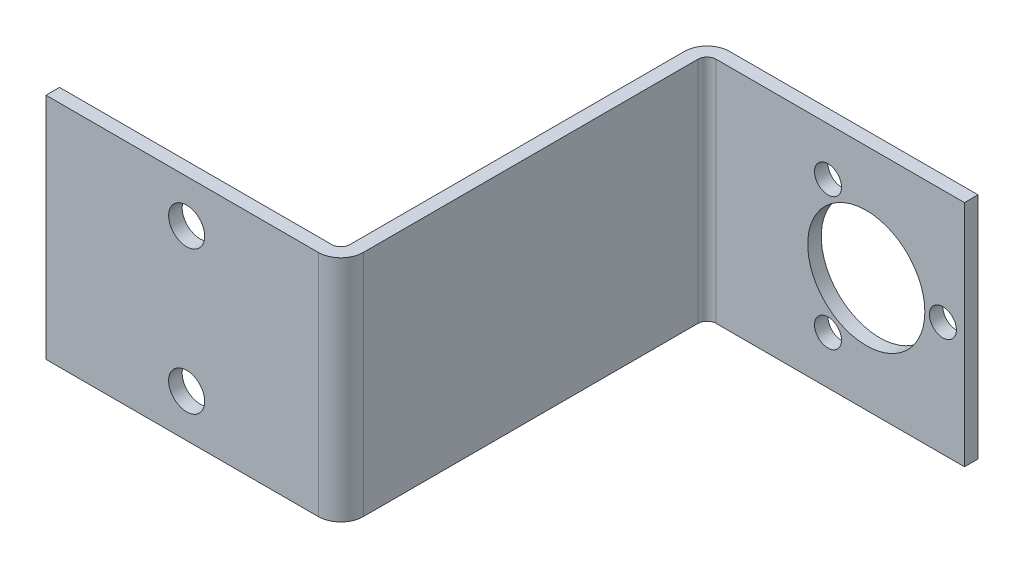
ISO-10303-21;
HEADER;
FILE_DESCRIPTION(('STEP AP214'),'2;1');
FILE_NAME('part.step','',(''),(''),'','','');
FILE_SCHEMA(('AUTOMOTIVE_DESIGN { 1 0 10303 214 1 1 1 1 }'));
ENDSEC;
DATA;
#1=APPLICATION_CONTEXT('core data for automotive mechanical design processes');
#2=APPLICATION_PROTOCOL_DEFINITION('international standard','automotive_design',2000,#1);
#3=PRODUCT_CONTEXT('',#1,'mechanical');
#4=PRODUCT('Part','Part','',(#3));
#5=PRODUCT_RELATED_PRODUCT_CATEGORY('part','',(#4));
#6=PRODUCT_DEFINITION_FORMATION('','',#4);
#7=PRODUCT_DEFINITION_CONTEXT('part definition',#1,'design');
#8=PRODUCT_DEFINITION('design','',#6,#7);
#9=PRODUCT_DEFINITION_SHAPE('','',#8);
#10=(LENGTH_UNIT() NAMED_UNIT(*) SI_UNIT(.MILLI.,.METRE.));
#11=(NAMED_UNIT(*) PLANE_ANGLE_UNIT() SI_UNIT($,.RADIAN.));
#12=(NAMED_UNIT(*) SI_UNIT($,.STERADIAN.) SOLID_ANGLE_UNIT());
#13=UNCERTAINTY_MEASURE_WITH_UNIT(LENGTH_MEASURE(1.E-05),#10,'distance_accuracy_value','');
#14=(GEOMETRIC_REPRESENTATION_CONTEXT(3) GLOBAL_UNCERTAINTY_ASSIGNED_CONTEXT((#13)) GLOBAL_UNIT_ASSIGNED_CONTEXT((#10,
#11,#12)) REPRESENTATION_CONTEXT('',''));
#15=CARTESIAN_POINT('',(0.,0.,0.));
#16=DIRECTION('',(0.,0.,1.));
#17=DIRECTION('',(1.,0.,0.));
#18=AXIS2_PLACEMENT_3D('',#15,#16,#17);
#19=CARTESIAN_POINT('',(-869.182676072549,25.4,43.4257102489601));
#20=DIRECTION('',(-1.,0.,0.));
#21=DIRECTION('',(0.,0.,1.));
#22=AXIS2_PLACEMENT_3D('',#19,#20,#21);
#23=PLANE('',#22);
#24=DIRECTION('',(0.,0.,-1.));
#25=VECTOR('',#24,1.);
#26=CARTESIAN_POINT('',(-869.182676072549,0.,43.4257102489601));
#27=LINE('',#26,#25);
#28=CARTESIAN_POINT('',(-869.182676072549,0.,43.4257102489601));
#29=VERTEX_POINT('',#28);
#30=CARTESIAN_POINT('',(-869.182676072549,0.,41.9257102489601));
#31=VERTEX_POINT('',#30);
#32=EDGE_CURVE('E139',#29,#31,#27,.T.);
#33=ORIENTED_EDGE('',*,*,#32,.T.);
#34=DIRECTION('',(0.,-1.,0.));
#35=VECTOR('',#34,1.);
#36=CARTESIAN_POINT('',(-869.182676072549,25.4,41.9257102489601));
#37=LINE('',#36,#35);
#38=CARTESIAN_POINT('',(-869.182676072549,25.4,41.9257102489601));
#39=VERTEX_POINT('',#38);
#40=EDGE_CURVE('E123',#39,#31,#37,.T.);
#41=ORIENTED_EDGE('',*,*,#40,.F.);
#42=DIRECTION('',(0.,0.,-1.));
#43=VECTOR('',#42,1.);
#44=CARTESIAN_POINT('',(-869.182676072549,25.4,43.4257102489601));
#45=LINE('',#44,#43);
#46=CARTESIAN_POINT('',(-869.182676072549,25.4,43.4257102489601));
#47=VERTEX_POINT('',#46);
#48=EDGE_CURVE('E126',#47,#39,#45,.T.);
#49=ORIENTED_EDGE('',*,*,#48,.F.);
#50=DIRECTION('',(0.,-1.,0.));
#51=VECTOR('',#50,1.);
#52=CARTESIAN_POINT('',(-869.182676072549,25.4,43.4257102489601));
#53=LINE('',#52,#51);
#54=EDGE_CURVE('E207',#47,#29,#53,.T.);
#55=ORIENTED_EDGE('',*,*,#54,.T.);
#56=EDGE_LOOP('',(#33,#41,#49,#55));
#57=FACE_BOUND('',#56,.T.);
#58=ADVANCED_FACE('F33',(#57),#23,.F.);
#59=CARTESIAN_POINT('',(-869.182676072549,25.4,41.9257102489601));
#60=DIRECTION('',(0.,0.,1.));
#61=DIRECTION('',(1.,0.,0.));
#62=AXIS2_PLACEMENT_3D('',#59,#60,#61);
#63=PLANE('',#62);
#64=CARTESIAN_POINT('',(-871.582676072304,12.7000000000415,41.9257102489601));
#65=DIRECTION('',(0.,0.,1.));
#66=DIRECTION('',(1.,0.,0.));
#67=AXIS2_PLACEMENT_3D('',#64,#65,#66);
#68=CIRCLE('',#67,1.5);
#69=CARTESIAN_POINT('',(-870.082676072304,12.7000000000415,41.9257102489601));
#70=VERTEX_POINT('',#69);
#71=EDGE_CURVE('E241',#70,#70,#68,.T.);
#72=ORIENTED_EDGE('',*,*,#71,.T.);
#73=EDGE_LOOP('',(#72));
#74=FACE_BOUND('',#73,.T.);
#75=CARTESIAN_POINT('',(-884.332676072304,5.33878406784143,41.9257102489601));
#76=DIRECTION('',(0.,0.,1.));
#77=DIRECTION('',(1.,0.,0.));
#78=AXIS2_PLACEMENT_3D('',#75,#76,#77);
#79=CIRCLE('',#78,1.49999999999999);
#80=CARTESIAN_POINT('',(-882.832676072304,5.33878406784143,41.9257102489601));
#81=VERTEX_POINT('',#80);
#82=EDGE_CURVE('E345',#81,#81,#79,.T.);
#83=ORIENTED_EDGE('',*,*,#82,.T.);
#84=EDGE_LOOP('',(#83));
#85=FACE_BOUND('',#84,.T.);
#86=CARTESIAN_POINT('',(-880.082676072304,12.7000000000414,41.9257102489601));
#87=DIRECTION('',(0.,0.,1.));
#88=DIRECTION('',(1.,0.,0.));
#89=AXIS2_PLACEMENT_3D('',#86,#87,#88);
#90=CIRCLE('',#89,6.49999999999995);
#91=CARTESIAN_POINT('',(-873.582676072304,12.7000000000414,41.9257102489601));
#92=VERTEX_POINT('',#91);
#93=EDGE_CURVE('E336',#92,#92,#90,.T.);
#94=ORIENTED_EDGE('',*,*,#93,.T.);
#95=EDGE_LOOP('',(#94));
#96=FACE_BOUND('',#95,.T.);
#97=CARTESIAN_POINT('',(-884.332676072304,20.0612159322414,41.9257102489601));
#98=DIRECTION('',(0.,0.,1.));
#99=DIRECTION('',(1.,0.,0.));
#100=AXIS2_PLACEMENT_3D('',#97,#98,#99);
#101=CIRCLE('',#100,1.49999999999998);
#102=CARTESIAN_POINT('',(-882.832676072304,20.0612159322414,41.9257102489601));
#103=VERTEX_POINT('',#102);
#104=EDGE_CURVE('E234',#103,#103,#101,.T.);
#105=ORIENTED_EDGE('',*,*,#104,.T.);
#106=EDGE_LOOP('',(#105));
#107=FACE_BOUND('',#106,.T.);
#108=DIRECTION('',(-1.,0.,0.));
#109=VECTOR('',#108,1.);
#110=CARTESIAN_POINT('',(-869.182676072549,0.,41.9257102489601));
#111=LINE('',#110,#109);
#112=CARTESIAN_POINT('',(-896.757676066549,0.,41.9257102489601));
#113=VERTEX_POINT('',#112);
#114=EDGE_CURVE('E193',#31,#113,#111,.T.);
#115=ORIENTED_EDGE('',*,*,#114,.T.);
#116=DIRECTION('',(0.,-1.,0.));
#117=VECTOR('',#116,1.);
#118=CARTESIAN_POINT('',(-896.757676066549,25.4,41.9257102489601));
#119=LINE('',#118,#117);
#120=CARTESIAN_POINT('',(-896.757676066549,25.4,41.9257102489601));
#121=VERTEX_POINT('',#120);
#122=EDGE_CURVE('E11',#113,#121,#119,.F.);
#123=ORIENTED_EDGE('',*,*,#122,.T.);
#124=DIRECTION('',(-1.,0.,0.));
#125=VECTOR('',#124,1.);
#126=CARTESIAN_POINT('',(-869.182676072549,25.4,41.9257102489601));
#127=LINE('',#126,#125);
#128=EDGE_CURVE('E119',#39,#121,#127,.T.);
#129=ORIENTED_EDGE('',*,*,#128,.F.);
#130=ORIENTED_EDGE('',*,*,#40,.T.);
#131=EDGE_LOOP('',(#115,#123,#129,#130));
#132=FACE_BOUND('',#131,.T.);
#133=ADVANCED_FACE('F121',(#74,#85,#96,#107,#132),#63,.F.);
#134=CARTESIAN_POINT('',(-899.257676066548,25.4,41.9257102489601));
#135=DIRECTION('',(1.,0.,0.));
#136=DIRECTION('',(0.,0.,-1.));
#137=AXIS2_PLACEMENT_3D('',#134,#135,#136);
#138=PLANE('',#137);
#139=DIRECTION('',(0.,0.,1.));
#140=VECTOR('',#139,1.);
#141=CARTESIAN_POINT('',(-899.257676066548,25.4,41.9257102489601));
#142=LINE('',#141,#140);
#143=CARTESIAN_POINT('',(-899.257676066548,25.4,44.4257102489601));
#144=VERTEX_POINT('',#143);
#145=CARTESIAN_POINT('',(-899.257676066548,25.4,81.5757102488869));
#146=VERTEX_POINT('',#145);
#147=EDGE_CURVE('E125',#144,#146,#142,.T.);
#148=ORIENTED_EDGE('',*,*,#147,.F.);
#149=DIRECTION('',(0.,-1.,0.));
#150=VECTOR('',#149,1.);
#151=CARTESIAN_POINT('',(-899.257676066548,25.4,44.4257102489601));
#152=LINE('',#151,#150);
#153=CARTESIAN_POINT('',(-899.257676066548,0.,44.4257102489601));
#154=VERTEX_POINT('',#153);
#155=EDGE_CURVE('E41',#144,#154,#152,.T.);
#156=ORIENTED_EDGE('',*,*,#155,.T.);
#157=DIRECTION('',(0.,0.,1.));
#158=VECTOR('',#157,1.);
#159=CARTESIAN_POINT('',(-899.257676066548,0.,41.9257102489601));
#160=LINE('',#159,#158);
#161=CARTESIAN_POINT('',(-899.257676066548,0.,81.5757102488869));
#162=VERTEX_POINT('',#161);
#163=EDGE_CURVE('E185',#154,#162,#160,.T.);
#164=ORIENTED_EDGE('',*,*,#163,.T.);
#165=DIRECTION('',(0.,-1.,0.));
#166=VECTOR('',#165,1.);
#167=CARTESIAN_POINT('',(-899.257676066548,25.4,81.5757102488869));
#168=LINE('',#167,#166);
#169=EDGE_CURVE('E144',#162,#146,#168,.F.);
#170=ORIENTED_EDGE('',*,*,#169,.T.);
#171=EDGE_LOOP('',(#148,#156,#164,#170));
#172=FACE_BOUND('',#171,.T.);
#173=ADVANCED_FACE('F184',(#172),#138,.F.);
#174=CARTESIAN_POINT('',(-899.257676066548,25.4,82.5757102488869));
#175=DIRECTION('',(0.,0.,1.));
#176=DIRECTION('',(1.,0.,0.));
#177=AXIS2_PLACEMENT_3D('',#174,#175,#176);
#178=PLANE('',#177);
#179=CARTESIAN_POINT('',(-914.870176066516,20.6375,82.5757102488869));
#180=DIRECTION('',(0.,0.,-1.));
#181=DIRECTION('',(-1.,0.,0.));
#182=AXIS2_PLACEMENT_3D('',#179,#180,#181);
#183=CIRCLE('',#182,2.);
#184=CARTESIAN_POINT('',(-916.870176066516,20.6375,82.5757102488869));
#185=VERTEX_POINT('',#184);
#186=EDGE_CURVE('E332',#185,#185,#183,.T.);
#187=ORIENTED_EDGE('',*,*,#186,.F.);
#188=EDGE_LOOP('',(#187));
#189=FACE_BOUND('',#188,.T.);
#190=CARTESIAN_POINT('',(-914.870176066516,4.7625,82.5757102488869));
#191=DIRECTION('',(0.,0.,-1.));
#192=DIRECTION('',(-1.,0.,0.));
#193=AXIS2_PLACEMENT_3D('',#190,#191,#192);
#194=CIRCLE('',#193,2.);
#195=CARTESIAN_POINT('',(-916.870176066516,4.7625,82.5757102488869));
#196=VERTEX_POINT('',#195);
#197=EDGE_CURVE('E325',#196,#196,#194,.T.);
#198=ORIENTED_EDGE('',*,*,#197,.F.);
#199=EDGE_LOOP('',(#198));
#200=FACE_BOUND('',#199,.T.);
#201=DIRECTION('',(-1.,0.,0.));
#202=VECTOR('',#201,1.);
#203=CARTESIAN_POINT('',(-899.257676066548,25.4,82.5757102488869));
#204=LINE('',#203,#202);
#205=CARTESIAN_POINT('',(-900.257676066548,25.4,82.5757102488869));
#206=VERTEX_POINT('',#205);
#207=CARTESIAN_POINT('',(-930.482676066483,25.4,82.5757102488869));
#208=VERTEX_POINT('',#207);
#209=EDGE_CURVE('E248',#206,#208,#204,.T.);
#210=ORIENTED_EDGE('',*,*,#209,.F.);
#211=DIRECTION('',(0.,-1.,0.));
#212=VECTOR('',#211,1.);
#213=CARTESIAN_POINT('',(-900.257676066548,0.,82.5757102488869));
#214=LINE('',#213,#212);
#215=CARTESIAN_POINT('',(-900.257676066548,0.,82.5757102488869));
#216=VERTEX_POINT('',#215);
#217=EDGE_CURVE('E140',#206,#216,#214,.T.);
#218=ORIENTED_EDGE('',*,*,#217,.T.);
#219=DIRECTION('',(-1.,0.,0.));
#220=VECTOR('',#219,1.);
#221=CARTESIAN_POINT('',(-899.257676066548,0.,82.5757102488869));
#222=LINE('',#221,#220);
#223=CARTESIAN_POINT('',(-930.482676066483,0.,82.5757102488869));
#224=VERTEX_POINT('',#223);
#225=EDGE_CURVE('E192',#216,#224,#222,.T.);
#226=ORIENTED_EDGE('',*,*,#225,.T.);
#227=DIRECTION('',(0.,-1.,0.));
#228=VECTOR('',#227,1.);
#229=CARTESIAN_POINT('',(-930.482676066483,25.4,82.5757102488869));
#230=LINE('',#229,#228);
#231=EDGE_CURVE('E141',#208,#224,#230,.T.);
#232=ORIENTED_EDGE('',*,*,#231,.F.);
#233=EDGE_LOOP('',(#210,#218,#226,#232));
#234=FACE_BOUND('',#233,.T.);
#235=ADVANCED_FACE('F253',(#189,#200,#234),#178,.F.);
#236=CARTESIAN_POINT('',(-930.482676066483,25.4,82.5757102488869));
#237=DIRECTION('',(1.,0.,0.));
#238=DIRECTION('',(0.,0.,-1.));
#239=AXIS2_PLACEMENT_3D('',#236,#237,#238);
#240=PLANE('',#239);
#241=DIRECTION('',(0.,0.,1.));
#242=VECTOR('',#241,1.);
#243=CARTESIAN_POINT('',(-930.482676066483,0.,82.5757102488869));
#244=LINE('',#243,#242);
#245=CARTESIAN_POINT('',(-930.482676066483,0.,84.0757102488869));
#246=VERTEX_POINT('',#245);
#247=EDGE_CURVE('E195',#224,#246,#244,.T.);
#248=ORIENTED_EDGE('',*,*,#247,.T.);
#249=DIRECTION('',(0.,-1.,0.));
#250=VECTOR('',#249,1.);
#251=CARTESIAN_POINT('',(-930.482676066483,25.4,84.0757102488869));
#252=LINE('',#251,#250);
#253=CARTESIAN_POINT('',(-930.482676066483,25.4,84.0757102488869));
#254=VERTEX_POINT('',#253);
#255=EDGE_CURVE('E147',#254,#246,#252,.T.);
#256=ORIENTED_EDGE('',*,*,#255,.F.);
#257=DIRECTION('',(0.,0.,1.));
#258=VECTOR('',#257,1.);
#259=CARTESIAN_POINT('',(-930.482676066483,25.4,82.5757102488869));
#260=LINE('',#259,#258);
#261=EDGE_CURVE('E231',#208,#254,#260,.T.);
#262=ORIENTED_EDGE('',*,*,#261,.F.);
#263=ORIENTED_EDGE('',*,*,#231,.T.);
#264=EDGE_LOOP('',(#248,#256,#262,#263));
#265=FACE_BOUND('',#264,.T.);
#266=ADVANCED_FACE('F251',(#265),#240,.F.);
#267=CARTESIAN_POINT('',(-930.482676066483,25.4,84.0757102488869));
#268=DIRECTION('',(0.,0.,-1.));
#269=DIRECTION('',(-1.,0.,0.));
#270=AXIS2_PLACEMENT_3D('',#267,#268,#269);
#271=PLANE('',#270);
#272=CARTESIAN_POINT('',(-914.870176066516,20.6375,84.0757102488869));
#273=DIRECTION('',(0.,0.,-1.));
#274=DIRECTION('',(-1.,0.,0.));
#275=AXIS2_PLACEMENT_3D('',#272,#273,#274);
#276=CIRCLE('',#275,2.);
#277=CARTESIAN_POINT('',(-916.870176066516,20.6375,84.0757102488869));
#278=VERTEX_POINT('',#277);
#279=EDGE_CURVE('E327',#278,#278,#276,.T.);
#280=ORIENTED_EDGE('',*,*,#279,.T.);
#281=EDGE_LOOP('',(#280));
#282=FACE_BOUND('',#281,.T.);
#283=CARTESIAN_POINT('',(-914.870176066516,4.7625,84.0757102488869));
#284=DIRECTION('',(0.,0.,-1.));
#285=DIRECTION('',(-1.,0.,0.));
#286=AXIS2_PLACEMENT_3D('',#283,#284,#285);
#287=CIRCLE('',#286,2.);
#288=CARTESIAN_POINT('',(-916.870176066516,4.7625,84.0757102488869));
#289=VERTEX_POINT('',#288);
#290=EDGE_CURVE('E322',#289,#289,#287,.T.);
#291=ORIENTED_EDGE('',*,*,#290,.T.);
#292=EDGE_LOOP('',(#291));
#293=FACE_BOUND('',#292,.T.);
#294=DIRECTION('',(1.,0.,0.));
#295=VECTOR('',#294,1.);
#296=CARTESIAN_POINT('',(-930.482676066483,0.,84.0757102488869));
#297=LINE('',#296,#295);
#298=CARTESIAN_POINT('',(-900.257676066548,0.,84.0757102488869));
#299=VERTEX_POINT('',#298);
#300=EDGE_CURVE('E201',#246,#299,#297,.T.);
#301=ORIENTED_EDGE('',*,*,#300,.T.);
#302=DIRECTION('',(0.,-1.,0.));
#303=VECTOR('',#302,1.);
#304=CARTESIAN_POINT('',(-900.257676066548,25.4,84.0757102488869));
#305=LINE('',#304,#303);
#306=CARTESIAN_POINT('',(-900.257676066548,25.4,84.0757102488869));
#307=VERTEX_POINT('',#306);
#308=EDGE_CURVE('E176',#299,#307,#305,.F.);
#309=ORIENTED_EDGE('',*,*,#308,.T.);
#310=DIRECTION('',(1.,0.,0.));
#311=VECTOR('',#310,1.);
#312=CARTESIAN_POINT('',(-930.482676066483,25.4,84.0757102488869));
#313=LINE('',#312,#311);
#314=EDGE_CURVE('E215',#254,#307,#313,.T.);
#315=ORIENTED_EDGE('',*,*,#314,.F.);
#316=ORIENTED_EDGE('',*,*,#255,.T.);
#317=EDGE_LOOP('',(#301,#309,#315,#316));
#318=FACE_BOUND('',#317,.T.);
#319=ADVANCED_FACE('F213',(#282,#293,#318),#271,.F.);
#320=CARTESIAN_POINT('',(-897.757676066549,25.4,84.0757102488869));
#321=DIRECTION('',(-1.,0.,0.));
#322=DIRECTION('',(0.,0.,1.));
#323=AXIS2_PLACEMENT_3D('',#320,#321,#322);
#324=PLANE('',#323);
#325=DIRECTION('',(0.,0.,-1.));
#326=VECTOR('',#325,1.);
#327=CARTESIAN_POINT('',(-897.757676066549,25.4,84.0757102488869));
#328=LINE('',#327,#326);
#329=CARTESIAN_POINT('',(-897.757676066549,25.4,81.5757102488869));
#330=VERTEX_POINT('',#329);
#331=CARTESIAN_POINT('',(-897.757676066549,25.4,44.4257102489601));
#332=VERTEX_POINT('',#331);
#333=EDGE_CURVE('E226',#330,#332,#328,.T.);
#334=ORIENTED_EDGE('',*,*,#333,.F.);
#335=DIRECTION('',(0.,-1.,0.));
#336=VECTOR('',#335,1.);
#337=CARTESIAN_POINT('',(-897.757676066549,25.4,81.5757102488869));
#338=LINE('',#337,#336);
#339=CARTESIAN_POINT('',(-897.757676066549,0.,81.5757102488869));
#340=VERTEX_POINT('',#339);
#341=EDGE_CURVE('E169',#330,#340,#338,.T.);
#342=ORIENTED_EDGE('',*,*,#341,.T.);
#343=DIRECTION('',(0.,0.,-1.));
#344=VECTOR('',#343,1.);
#345=CARTESIAN_POINT('',(-897.757676066549,0.,84.0757102488869));
#346=LINE('',#345,#344);
#347=CARTESIAN_POINT('',(-897.757676066549,0.,44.4257102489601));
#348=VERTEX_POINT('',#347);
#349=EDGE_CURVE('E204',#340,#348,#346,.T.);
#350=ORIENTED_EDGE('',*,*,#349,.T.);
#351=DIRECTION('',(0.,-1.,0.));
#352=VECTOR('',#351,1.);
#353=CARTESIAN_POINT('',(-897.757676066549,25.4,44.4257102489601));
#354=LINE('',#353,#352);
#355=EDGE_CURVE('E156',#348,#332,#354,.F.);
#356=ORIENTED_EDGE('',*,*,#355,.T.);
#357=EDGE_LOOP('',(#334,#342,#350,#356));
#358=FACE_BOUND('',#357,.T.);
#359=ADVANCED_FACE('F225',(#358),#324,.F.);
#360=CARTESIAN_POINT('',(-897.757676066549,25.4,43.4257102489601));
#361=DIRECTION('',(0.,0.,-1.));
#362=DIRECTION('',(-1.,0.,0.));
#363=AXIS2_PLACEMENT_3D('',#360,#361,#362);
#364=PLANE('',#363);
#365=CARTESIAN_POINT('',(-871.582676072304,12.7000000000415,43.4257102489601));
#366=DIRECTION('',(0.,0.,1.));
#367=DIRECTION('',(1.,0.,0.));
#368=AXIS2_PLACEMENT_3D('',#365,#366,#367);
#369=CIRCLE('',#368,1.5);
#370=CARTESIAN_POINT('',(-870.082676072304,12.7000000000415,43.4257102489601));
#371=VERTEX_POINT('',#370);
#372=EDGE_CURVE('E343',#371,#371,#369,.T.);
#373=ORIENTED_EDGE('',*,*,#372,.F.);
#374=EDGE_LOOP('',(#373));
#375=FACE_BOUND('',#374,.T.);
#376=CARTESIAN_POINT('',(-884.332676072304,5.33878406784143,43.4257102489601));
#377=DIRECTION('',(0.,0.,1.));
#378=DIRECTION('',(1.,0.,0.));
#379=AXIS2_PLACEMENT_3D('',#376,#377,#378);
#380=CIRCLE('',#379,1.49999999999999);
#381=CARTESIAN_POINT('',(-882.832676072304,5.33878406784143,43.4257102489601));
#382=VERTEX_POINT('',#381);
#383=EDGE_CURVE('E244',#382,#382,#380,.T.);
#384=ORIENTED_EDGE('',*,*,#383,.F.);
#385=EDGE_LOOP('',(#384));
#386=FACE_BOUND('',#385,.T.);
#387=CARTESIAN_POINT('',(-880.082676072304,12.7000000000414,43.4257102489601));
#388=DIRECTION('',(0.,0.,1.));
#389=DIRECTION('',(1.,0.,0.));
#390=AXIS2_PLACEMENT_3D('',#387,#388,#389);
#391=CIRCLE('',#390,6.49999999999995);
#392=CARTESIAN_POINT('',(-873.582676072304,12.7000000000414,43.4257102489601));
#393=VERTEX_POINT('',#392);
#394=EDGE_CURVE('E329',#393,#393,#391,.T.);
#395=ORIENTED_EDGE('',*,*,#394,.F.);
#396=EDGE_LOOP('',(#395));
#397=FACE_BOUND('',#396,.T.);
#398=CARTESIAN_POINT('',(-884.332676072304,20.0612159322414,43.4257102489601));
#399=DIRECTION('',(0.,0.,1.));
#400=DIRECTION('',(1.,0.,0.));
#401=AXIS2_PLACEMENT_3D('',#398,#399,#400);
#402=CIRCLE('',#401,1.49999999999998);
#403=CARTESIAN_POINT('',(-882.832676072304,20.0612159322414,43.4257102489601));
#404=VERTEX_POINT('',#403);
#405=EDGE_CURVE('E236',#404,#404,#402,.T.);
#406=ORIENTED_EDGE('',*,*,#405,.F.);
#407=EDGE_LOOP('',(#406));
#408=FACE_BOUND('',#407,.T.);
#409=DIRECTION('',(1.,0.,0.));
#410=VECTOR('',#409,1.);
#411=CARTESIAN_POINT('',(-897.757676066549,25.4,43.4257102489601));
#412=LINE('',#411,#410);
#413=CARTESIAN_POINT('',(-896.757676066549,25.4,43.4257102489601));
#414=VERTEX_POINT('',#413);
#415=EDGE_CURVE('E132',#414,#47,#412,.T.);
#416=ORIENTED_EDGE('',*,*,#415,.F.);
#417=DIRECTION('',(0.,-1.,0.));
#418=VECTOR('',#417,1.);
#419=CARTESIAN_POINT('',(-896.757676066549,0.,43.4257102489601));
#420=LINE('',#419,#418);
#421=CARTESIAN_POINT('',(-896.757676066549,0.,43.4257102489601));
#422=VERTEX_POINT('',#421);
#423=EDGE_CURVE('E153',#414,#422,#420,.T.);
#424=ORIENTED_EDGE('',*,*,#423,.T.);
#425=DIRECTION('',(1.,0.,0.));
#426=VECTOR('',#425,1.);
#427=CARTESIAN_POINT('',(-897.757676066549,0.,43.4257102489601));
#428=LINE('',#427,#426);
#429=EDGE_CURVE('E136',#422,#29,#428,.T.);
#430=ORIENTED_EDGE('',*,*,#429,.T.);
#431=ORIENTED_EDGE('',*,*,#54,.F.);
#432=EDGE_LOOP('',(#416,#424,#430,#431));
#433=FACE_BOUND('',#432,.T.);
#434=ADVANCED_FACE('F291',(#375,#386,#397,#408,#433),#364,.F.);
#435=CARTESIAN_POINT('',(0.,25.4,0.));
#436=DIRECTION('',(0.,1.,0.));
#437=DIRECTION('',(0.,0.,1.));
#438=AXIS2_PLACEMENT_3D('',#435,#436,#437);
#439=PLANE('',#438);
#440=ORIENTED_EDGE('',*,*,#314,.T.);
#441=CARTESIAN_POINT('',(-900.257676066548,25.4,81.5757102488869));
#442=DIRECTION('',(0.,1.,0.));
#443=DIRECTION('',(0.,0.,1.));
#444=AXIS2_PLACEMENT_3D('',#441,#442,#443);
#445=CIRCLE('',#444,2.5);
#446=EDGE_CURVE('E179',#307,#330,#445,.T.);
#447=ORIENTED_EDGE('',*,*,#446,.T.);
#448=ORIENTED_EDGE('',*,*,#333,.T.);
#449=CARTESIAN_POINT('',(-896.757676066549,25.4,44.4257102489601));
#450=DIRECTION('',(0.,1.,0.));
#451=DIRECTION('',(0.,0.,1.));
#452=AXIS2_PLACEMENT_3D('',#449,#450,#451);
#453=CIRCLE('',#452,1.);
#454=EDGE_CURVE('E167',#332,#414,#453,.F.);
#455=ORIENTED_EDGE('',*,*,#454,.T.);
#456=ORIENTED_EDGE('',*,*,#415,.T.);
#457=ORIENTED_EDGE('',*,*,#48,.T.);
#458=ORIENTED_EDGE('',*,*,#128,.T.);
#459=CARTESIAN_POINT('',(-896.757676066549,25.4,44.4257102489601));
#460=DIRECTION('',(0.,1.,0.));
#461=DIRECTION('',(0.,0.,1.));
#462=AXIS2_PLACEMENT_3D('',#459,#460,#461);
#463=CIRCLE('',#462,2.5);
#464=EDGE_CURVE('E48',#121,#144,#463,.T.);
#465=ORIENTED_EDGE('',*,*,#464,.T.);
#466=ORIENTED_EDGE('',*,*,#147,.T.);
#467=CARTESIAN_POINT('',(-900.257676066548,25.4,81.5757102488869));
#468=DIRECTION('',(0.,1.,0.));
#469=DIRECTION('',(0.,0.,1.));
#470=AXIS2_PLACEMENT_3D('',#467,#468,#469);
#471=CIRCLE('',#470,1.);
#472=EDGE_CURVE('E162',#146,#206,#471,.F.);
#473=ORIENTED_EDGE('',*,*,#472,.T.);
#474=ORIENTED_EDGE('',*,*,#209,.T.);
#475=ORIENTED_EDGE('',*,*,#261,.T.);
#476=EDGE_LOOP('',(#440,#447,#448,#455,#456,#457,#458,#465,#466,#473,#474,#475));
#477=FACE_BOUND('',#476,.T.);
#478=ADVANCED_FACE('F130',(#477),#439,.T.);
#479=CARTESIAN_POINT('',(0.,0.,0.));
#480=DIRECTION('',(0.,1.,0.));
#481=DIRECTION('',(0.,0.,1.));
#482=AXIS2_PLACEMENT_3D('',#479,#480,#481);
#483=PLANE('',#482);
#484=ORIENTED_EDGE('',*,*,#349,.F.);
#485=CARTESIAN_POINT('',(-900.257676066548,0.,81.5757102488869));
#486=DIRECTION('',(0.,1.,0.));
#487=DIRECTION('',(0.,0.,1.));
#488=AXIS2_PLACEMENT_3D('',#485,#486,#487);
#489=CIRCLE('',#488,2.5);
#490=EDGE_CURVE('E174',#340,#299,#489,.F.);
#491=ORIENTED_EDGE('',*,*,#490,.T.);
#492=ORIENTED_EDGE('',*,*,#300,.F.);
#493=ORIENTED_EDGE('',*,*,#247,.F.);
#494=ORIENTED_EDGE('',*,*,#225,.F.);
#495=CARTESIAN_POINT('',(-900.257676066548,0.,81.5757102488869));
#496=DIRECTION('',(0.,1.,0.));
#497=DIRECTION('',(0.,0.,1.));
#498=AXIS2_PLACEMENT_3D('',#495,#496,#497);
#499=CIRCLE('',#498,1.);
#500=EDGE_CURVE('E159',#216,#162,#499,.T.);
#501=ORIENTED_EDGE('',*,*,#500,.T.);
#502=ORIENTED_EDGE('',*,*,#163,.F.);
#503=CARTESIAN_POINT('',(-896.757676066549,0.,44.4257102489601));
#504=DIRECTION('',(0.,1.,0.));
#505=DIRECTION('',(0.,0.,1.));
#506=AXIS2_PLACEMENT_3D('',#503,#504,#505);
#507=CIRCLE('',#506,2.5);
#508=EDGE_CURVE('E172',#154,#113,#507,.F.);
#509=ORIENTED_EDGE('',*,*,#508,.T.);
#510=ORIENTED_EDGE('',*,*,#114,.F.);
#511=ORIENTED_EDGE('',*,*,#32,.F.);
#512=ORIENTED_EDGE('',*,*,#429,.F.);
#513=CARTESIAN_POINT('',(-896.757676066549,0.,44.4257102489601));
#514=DIRECTION('',(0.,1.,0.));
#515=DIRECTION('',(0.,0.,1.));
#516=AXIS2_PLACEMENT_3D('',#513,#514,#515);
#517=CIRCLE('',#516,1.);
#518=EDGE_CURVE('E164',#422,#348,#517,.T.);
#519=ORIENTED_EDGE('',*,*,#518,.T.);
#520=EDGE_LOOP('',(#484,#491,#492,#493,#494,#501,#502,#509,#510,#511,#512,#519));
#521=FACE_BOUND('',#520,.T.);
#522=ADVANCED_FACE('F189',(#521),#483,.F.);
#523=CARTESIAN_POINT('',(-884.332676072304,20.0612159322414,41.9257102489601));
#524=DIRECTION('',(0.,0.,1.));
#525=DIRECTION('',(1.,0.,0.));
#526=AXIS2_PLACEMENT_3D('',#523,#524,#525);
#527=CYLINDRICAL_SURFACE('',#526,1.49999999999998);
#528=ORIENTED_EDGE('',*,*,#405,.T.);
#529=EDGE_LOOP('',(#528));
#530=FACE_BOUND('',#529,.T.);
#531=ORIENTED_EDGE('',*,*,#104,.F.);
#532=EDGE_LOOP('',(#531));
#533=FACE_BOUND('',#532,.T.);
#534=ADVANCED_FACE('F297',(#530,#533),#527,.F.);
#535=CARTESIAN_POINT('',(-880.082676072304,12.7000000000414,41.9257102489601));
#536=DIRECTION('',(0.,0.,1.));
#537=DIRECTION('',(1.,0.,0.));
#538=AXIS2_PLACEMENT_3D('',#535,#536,#537);
#539=CYLINDRICAL_SURFACE('',#538,6.49999999999995);
#540=ORIENTED_EDGE('',*,*,#394,.T.);
#541=EDGE_LOOP('',(#540));
#542=FACE_BOUND('',#541,.T.);
#543=ORIENTED_EDGE('',*,*,#93,.F.);
#544=EDGE_LOOP('',(#543));
#545=FACE_BOUND('',#544,.T.);
#546=ADVANCED_FACE('F302',(#542,#545),#539,.F.);
#547=CARTESIAN_POINT('',(-884.332676072304,5.33878406784143,41.9257102489601));
#548=DIRECTION('',(0.,0.,1.));
#549=DIRECTION('',(1.,0.,0.));
#550=AXIS2_PLACEMENT_3D('',#547,#548,#549);
#551=CYLINDRICAL_SURFACE('',#550,1.49999999999999);
#552=ORIENTED_EDGE('',*,*,#383,.T.);
#553=EDGE_LOOP('',(#552));
#554=FACE_BOUND('',#553,.T.);
#555=ORIENTED_EDGE('',*,*,#82,.F.);
#556=EDGE_LOOP('',(#555));
#557=FACE_BOUND('',#556,.T.);
#558=ADVANCED_FACE('F304',(#554,#557),#551,.F.);
#559=CARTESIAN_POINT('',(-871.582676072304,12.7000000000415,41.9257102489601));
#560=DIRECTION('',(0.,0.,1.));
#561=DIRECTION('',(1.,0.,0.));
#562=AXIS2_PLACEMENT_3D('',#559,#560,#561);
#563=CYLINDRICAL_SURFACE('',#562,1.5);
#564=ORIENTED_EDGE('',*,*,#372,.T.);
#565=EDGE_LOOP('',(#564));
#566=FACE_BOUND('',#565,.T.);
#567=ORIENTED_EDGE('',*,*,#71,.F.);
#568=EDGE_LOOP('',(#567));
#569=FACE_BOUND('',#568,.T.);
#570=ADVANCED_FACE('F307',(#566,#569),#563,.F.);
#571=CARTESIAN_POINT('',(-914.870176066516,4.7625,82.5757102488869));
#572=DIRECTION('',(0.,0.,-1.));
#573=DIRECTION('',(-1.,0.,0.));
#574=AXIS2_PLACEMENT_3D('',#571,#572,#573);
#575=CYLINDRICAL_SURFACE('',#574,2.);
#576=ORIENTED_EDGE('',*,*,#290,.F.);
#577=EDGE_LOOP('',(#576));
#578=FACE_BOUND('',#577,.T.);
#579=ORIENTED_EDGE('',*,*,#197,.T.);
#580=EDGE_LOOP('',(#579));
#581=FACE_BOUND('',#580,.T.);
#582=ADVANCED_FACE('F268',(#578,#581),#575,.F.);
#583=CARTESIAN_POINT('',(-914.870176066516,20.6375,82.5757102488869));
#584=DIRECTION('',(0.,0.,-1.));
#585=DIRECTION('',(-1.,0.,0.));
#586=AXIS2_PLACEMENT_3D('',#583,#584,#585);
#587=CYLINDRICAL_SURFACE('',#586,2.);
#588=ORIENTED_EDGE('',*,*,#279,.F.);
#589=EDGE_LOOP('',(#588));
#590=FACE_BOUND('',#589,.T.);
#591=ORIENTED_EDGE('',*,*,#186,.T.);
#592=EDGE_LOOP('',(#591));
#593=FACE_BOUND('',#592,.T.);
#594=ADVANCED_FACE('F260',(#590,#593),#587,.F.);
#595=CARTESIAN_POINT('',(-900.257676066548,25.4,81.5757102488869));
#596=DIRECTION('',(0.,1.,0.));
#597=DIRECTION('',(0.,0.,1.));
#598=AXIS2_PLACEMENT_3D('',#595,#596,#597);
#599=CYLINDRICAL_SURFACE('',#598,1.);
#600=ORIENTED_EDGE('',*,*,#472,.F.);
#601=ORIENTED_EDGE('',*,*,#169,.F.);
#602=ORIENTED_EDGE('',*,*,#500,.F.);
#603=ORIENTED_EDGE('',*,*,#217,.F.);
#604=EDGE_LOOP('',(#600,#601,#602,#603));
#605=FACE_BOUND('',#604,.T.);
#606=ADVANCED_FACE('F257',(#605),#599,.F.);
#607=CARTESIAN_POINT('',(-896.757676066549,25.4,44.4257102489601));
#608=DIRECTION('',(0.,1.,0.));
#609=DIRECTION('',(0.,0.,1.));
#610=AXIS2_PLACEMENT_3D('',#607,#608,#609);
#611=CYLINDRICAL_SURFACE('',#610,1.);
#612=ORIENTED_EDGE('',*,*,#454,.F.);
#613=ORIENTED_EDGE('',*,*,#355,.F.);
#614=ORIENTED_EDGE('',*,*,#518,.F.);
#615=ORIENTED_EDGE('',*,*,#423,.F.);
#616=EDGE_LOOP('',(#612,#613,#614,#615));
#617=FACE_BOUND('',#616,.T.);
#618=ADVANCED_FACE('F259',(#617),#611,.F.);
#619=CARTESIAN_POINT('',(-900.257676066548,25.4,81.5757102488869));
#620=DIRECTION('',(0.,-1.,0.));
#621=DIRECTION('',(0.,0.,-1.));
#622=AXIS2_PLACEMENT_3D('',#619,#620,#621);
#623=CYLINDRICAL_SURFACE('',#622,2.5);
#624=ORIENTED_EDGE('',*,*,#446,.F.);
#625=ORIENTED_EDGE('',*,*,#308,.F.);
#626=ORIENTED_EDGE('',*,*,#490,.F.);
#627=ORIENTED_EDGE('',*,*,#341,.F.);
#628=EDGE_LOOP('',(#624,#625,#626,#627));
#629=FACE_BOUND('',#628,.T.);
#630=ADVANCED_FACE('F222',(#629),#623,.T.);
#631=CARTESIAN_POINT('',(-896.757676066549,25.4,44.4257102489601));
#632=DIRECTION('',(0.,-1.,0.));
#633=DIRECTION('',(0.,0.,-1.));
#634=AXIS2_PLACEMENT_3D('',#631,#632,#633);
#635=CYLINDRICAL_SURFACE('',#634,2.5);
#636=ORIENTED_EDGE('',*,*,#464,.F.);
#637=ORIENTED_EDGE('',*,*,#122,.F.);
#638=ORIENTED_EDGE('',*,*,#508,.F.);
#639=ORIENTED_EDGE('',*,*,#155,.F.);
#640=EDGE_LOOP('',(#636,#637,#638,#639));
#641=FACE_BOUND('',#640,.T.);
#642=ADVANCED_FACE('F35',(#641),#635,.T.);
#643=CLOSED_SHELL('',(#58,#133,#173,#235,#266,#319,#359,#434,#478,#522,#534,#546,#558,#570,#582,
#594,#606,#618,#630,#642));
#644=MANIFOLD_SOLID_BREP('B2',#643);
#645=ADVANCED_BREP_SHAPE_REPRESENTATION('',(#18,#644),#14);
#646=SHAPE_DEFINITION_REPRESENTATION(#9,#645);
ENDSEC;
END-ISO-10303-21;
